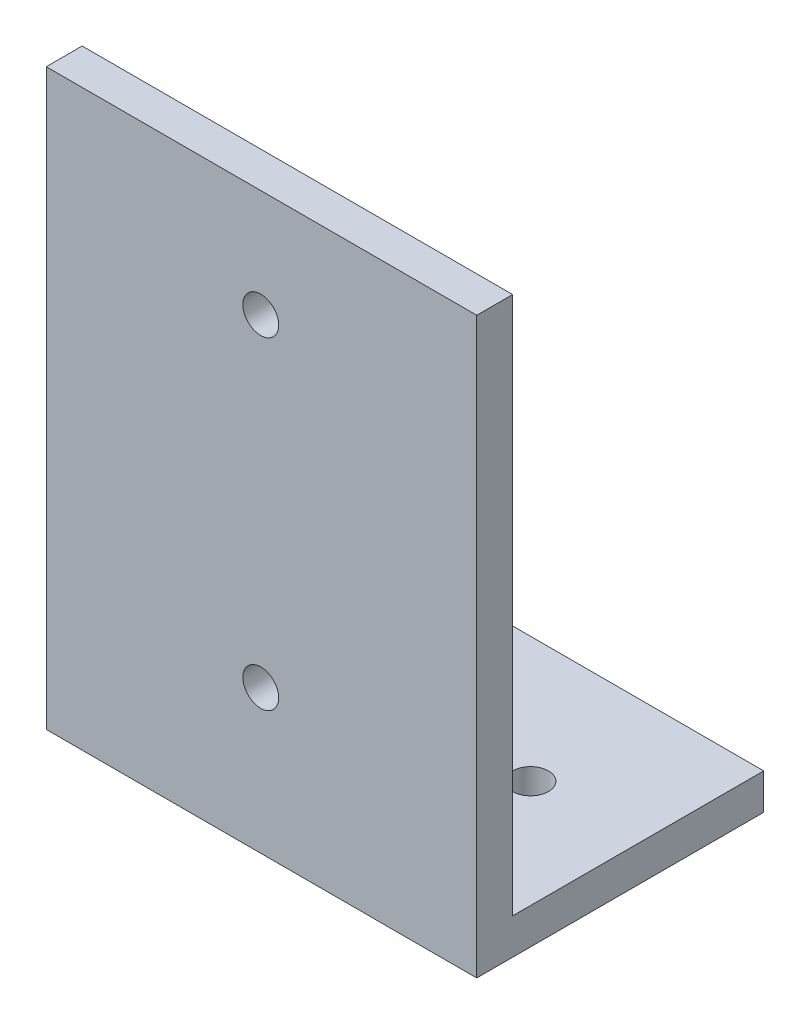
ISO-10303-21;
HEADER;
FILE_DESCRIPTION(('STEP AP214'),'2;1');
FILE_NAME('part.step','',(''),(''),'','','');
FILE_SCHEMA(('AUTOMOTIVE_DESIGN { 1 0 10303 214 1 1 1 1 }'));
ENDSEC;
DATA;
#1=APPLICATION_CONTEXT('core data for automotive mechanical design processes');
#2=APPLICATION_PROTOCOL_DEFINITION('international standard','automotive_design',2000,#1);
#3=PRODUCT_CONTEXT('',#1,'mechanical');
#4=PRODUCT('Part','Part','',(#3));
#5=PRODUCT_RELATED_PRODUCT_CATEGORY('part','',(#4));
#6=PRODUCT_DEFINITION_FORMATION('','',#4);
#7=PRODUCT_DEFINITION_CONTEXT('part definition',#1,'design');
#8=PRODUCT_DEFINITION('design','',#6,#7);
#9=PRODUCT_DEFINITION_SHAPE('','',#8);
#10=(LENGTH_UNIT() NAMED_UNIT(*) SI_UNIT(.MILLI.,.METRE.));
#11=(NAMED_UNIT(*) PLANE_ANGLE_UNIT() SI_UNIT($,.RADIAN.));
#12=(NAMED_UNIT(*) SI_UNIT($,.STERADIAN.) SOLID_ANGLE_UNIT());
#13=UNCERTAINTY_MEASURE_WITH_UNIT(LENGTH_MEASURE(1.E-05),#10,'distance_accuracy_value','');
#14=(GEOMETRIC_REPRESENTATION_CONTEXT(3) GLOBAL_UNCERTAINTY_ASSIGNED_CONTEXT((#13)) GLOBAL_UNIT_ASSIGNED_CONTEXT((#10,
#11,#12)) REPRESENTATION_CONTEXT('',''));
#15=CARTESIAN_POINT('',(0.,0.,0.));
#16=DIRECTION('',(0.,0.,1.));
#17=DIRECTION('',(1.,0.,0.));
#18=AXIS2_PLACEMENT_3D('',#15,#16,#17);
#19=CARTESIAN_POINT('',(38.1,0.,0.));
#20=DIRECTION('',(0.,1.,0.));
#21=DIRECTION('',(0.,0.,1.));
#22=AXIS2_PLACEMENT_3D('',#19,#20,#21);
#23=PLANE('',#22);
#24=CARTESIAN_POINT('',(28.575,0.,-14.2875));
#25=DIRECTION('',(0.,1.,0.));
#26=DIRECTION('',(0.,0.,1.));
#27=AXIS2_PLACEMENT_3D('',#24,#25,#26);
#28=CIRCLE('',#27,1.5875);
#29=CARTESIAN_POINT('',(28.575,0.,-12.7));
#30=VERTEX_POINT('',#29);
#31=EDGE_CURVE('E144',#30,#30,#28,.F.);
#32=ORIENTED_EDGE('',*,*,#31,.F.);
#33=EDGE_LOOP('',(#32));
#34=FACE_BOUND('',#33,.T.);
#35=CARTESIAN_POINT('',(9.52500000000001,0.,-14.2875));
#36=DIRECTION('',(0.,1.,0.));
#37=DIRECTION('',(0.,0.,1.));
#38=AXIS2_PLACEMENT_3D('',#35,#36,#37);
#39=CIRCLE('',#38,1.5875);
#40=CARTESIAN_POINT('',(9.52500000000001,0.,-12.7));
#41=VERTEX_POINT('',#40);
#42=EDGE_CURVE('E197',#41,#41,#39,.F.);
#43=ORIENTED_EDGE('',*,*,#42,.F.);
#44=EDGE_LOOP('',(#43));
#45=FACE_BOUND('',#44,.T.);
#46=DIRECTION('',(0.,0.,-1.));
#47=VECTOR('',#46,1.);
#48=CARTESIAN_POINT('',(0.,0.,0.));
#49=LINE('',#48,#47);
#50=CARTESIAN_POINT('',(0.,0.,0.));
#51=VERTEX_POINT('',#50);
#52=CARTESIAN_POINT('',(0.,0.,-25.4));
#53=VERTEX_POINT('',#52);
#54=EDGE_CURVE('E139',#51,#53,#49,.T.);
#55=ORIENTED_EDGE('',*,*,#54,.T.);
#56=DIRECTION('',(-1.,0.,0.));
#57=VECTOR('',#56,1.);
#58=CARTESIAN_POINT('',(38.1,0.,-25.4));
#59=LINE('',#58,#57);
#60=CARTESIAN_POINT('',(38.1,0.,-25.4));
#61=VERTEX_POINT('',#60);
#62=EDGE_CURVE('E11',#61,#53,#59,.T.);
#63=ORIENTED_EDGE('',*,*,#62,.F.);
#64=DIRECTION('',(0.,0.,-1.));
#65=VECTOR('',#64,1.);
#66=CARTESIAN_POINT('',(38.1,0.,0.));
#67=LINE('',#66,#65);
#68=CARTESIAN_POINT('',(38.1,0.,0.));
#69=VERTEX_POINT('',#68);
#70=EDGE_CURVE('E156',#69,#61,#67,.T.);
#71=ORIENTED_EDGE('',*,*,#70,.F.);
#72=DIRECTION('',(-1.,0.,0.));
#73=VECTOR('',#72,1.);
#74=CARTESIAN_POINT('',(38.1,0.,0.));
#75=LINE('',#74,#73);
#76=EDGE_CURVE('E135',#69,#51,#75,.T.);
#77=ORIENTED_EDGE('',*,*,#76,.T.);
#78=EDGE_LOOP('',(#55,#63,#71,#77));
#79=FACE_BOUND('',#78,.T.);
#80=ADVANCED_FACE('F38',(#34,#45,#79),#23,.F.);
#81=CARTESIAN_POINT('',(38.1,0.,-25.4));
#82=DIRECTION('',(0.,0.,1.));
#83=DIRECTION('',(1.,0.,0.));
#84=AXIS2_PLACEMENT_3D('',#81,#82,#83);
#85=PLANE('',#84);
#86=DIRECTION('',(0.,1.,0.));
#87=VECTOR('',#86,1.);
#88=CARTESIAN_POINT('',(0.,0.,-25.4));
#89=LINE('',#88,#87);
#90=CARTESIAN_POINT('',(0.,3.175,-25.4));
#91=VERTEX_POINT('',#90);
#92=EDGE_CURVE('E143',#53,#91,#89,.T.);
#93=ORIENTED_EDGE('',*,*,#92,.T.);
#94=DIRECTION('',(-1.,0.,0.));
#95=VECTOR('',#94,1.);
#96=CARTESIAN_POINT('',(38.1,3.175,-25.4));
#97=LINE('',#96,#95);
#98=CARTESIAN_POINT('',(38.1,3.175,-25.4));
#99=VERTEX_POINT('',#98);
#100=EDGE_CURVE('E47',#99,#91,#97,.T.);
#101=ORIENTED_EDGE('',*,*,#100,.F.);
#102=DIRECTION('',(0.,1.,0.));
#103=VECTOR('',#102,1.);
#104=CARTESIAN_POINT('',(38.1,0.,-25.4));
#105=LINE('',#104,#103);
#106=EDGE_CURVE('E104',#61,#99,#105,.T.);
#107=ORIENTED_EDGE('',*,*,#106,.F.);
#108=ORIENTED_EDGE('',*,*,#62,.T.);
#109=EDGE_LOOP('',(#93,#101,#107,#108));
#110=FACE_BOUND('',#109,.T.);
#111=ADVANCED_FACE('F187',(#110),#85,.F.);
#112=CARTESIAN_POINT('',(38.1,3.175,-3.175));
#113=DIRECTION('',(0.,-1.,0.));
#114=DIRECTION('',(0.,0.,-1.));
#115=AXIS2_PLACEMENT_3D('',#112,#113,#114);
#116=PLANE('',#115);
#117=CARTESIAN_POINT('',(28.575,3.175,-14.2875));
#118=DIRECTION('',(0.,1.,0.));
#119=DIRECTION('',(0.,0.,1.));
#120=AXIS2_PLACEMENT_3D('',#117,#118,#119);
#121=CIRCLE('',#120,1.5875);
#122=CARTESIAN_POINT('',(28.575,3.175,-12.7));
#123=VERTEX_POINT('',#122);
#124=EDGE_CURVE('E200',#123,#123,#121,.T.);
#125=ORIENTED_EDGE('',*,*,#124,.F.);
#126=EDGE_LOOP('',(#125));
#127=FACE_BOUND('',#126,.T.);
#128=CARTESIAN_POINT('',(9.52500000000001,3.175,-14.2875));
#129=DIRECTION('',(0.,1.,0.));
#130=DIRECTION('',(0.,0.,-1.));
#131=AXIS2_PLACEMENT_3D('',#128,#129,#130);
#132=CIRCLE('',#131,1.5875);
#133=CARTESIAN_POINT('',(9.52500000000001,3.175,-15.875));
#134=VERTEX_POINT('',#133);
#135=EDGE_CURVE('E201',#134,#134,#132,.T.);
#136=ORIENTED_EDGE('',*,*,#135,.F.);
#137=EDGE_LOOP('',(#136));
#138=FACE_BOUND('',#137,.T.);
#139=DIRECTION('',(0.,0.,1.));
#140=VECTOR('',#139,1.);
#141=CARTESIAN_POINT('',(0.,3.175,-3.175));
#142=LINE('',#141,#140);
#143=CARTESIAN_POINT('',(0.,3.175,-3.175));
#144=VERTEX_POINT('',#143);
#145=EDGE_CURVE('E147',#91,#144,#142,.T.);
#146=ORIENTED_EDGE('',*,*,#145,.T.);
#147=DIRECTION('',(-1.,0.,0.));
#148=VECTOR('',#147,1.);
#149=CARTESIAN_POINT('',(38.1,3.175,-3.175));
#150=LINE('',#149,#148);
#151=CARTESIAN_POINT('',(38.1,3.175,-3.175));
#152=VERTEX_POINT('',#151);
#153=EDGE_CURVE('E128',#152,#144,#150,.T.);
#154=ORIENTED_EDGE('',*,*,#153,.F.);
#155=DIRECTION('',(0.,0.,1.));
#156=VECTOR('',#155,1.);
#157=CARTESIAN_POINT('',(38.1,3.175,-3.175));
#158=LINE('',#157,#156);
#159=EDGE_CURVE('E117',#99,#152,#158,.T.);
#160=ORIENTED_EDGE('',*,*,#159,.F.);
#161=ORIENTED_EDGE('',*,*,#100,.T.);
#162=EDGE_LOOP('',(#146,#154,#160,#161));
#163=FACE_BOUND('',#162,.T.);
#164=ADVANCED_FACE('F166',(#127,#138,#163),#116,.F.);
#165=CARTESIAN_POINT('',(38.1,3.175,-3.175));
#166=DIRECTION('',(0.,0.,1.));
#167=DIRECTION('',(1.,0.,0.));
#168=AXIS2_PLACEMENT_3D('',#165,#166,#167);
#169=PLANE('',#168);
#170=CARTESIAN_POINT('',(18.9832981964173,12.7,-3.175));
#171=DIRECTION('',(0.,0.,-1.));
#172=DIRECTION('',(-1.,0.,0.));
#173=AXIS2_PLACEMENT_3D('',#170,#171,#172);
#174=CIRCLE('',#173,1.5875);
#175=CARTESIAN_POINT('',(17.3957981964173,12.7,-3.175));
#176=VERTEX_POINT('',#175);
#177=EDGE_CURVE('E222',#176,#176,#174,.T.);
#178=ORIENTED_EDGE('',*,*,#177,.F.);
#179=EDGE_LOOP('',(#178));
#180=FACE_BOUND('',#179,.T.);
#181=CARTESIAN_POINT('',(18.9832981964173,41.275,-3.175));
#182=DIRECTION('',(0.,0.,-1.));
#183=DIRECTION('',(1.,0.,0.));
#184=AXIS2_PLACEMENT_3D('',#181,#182,#183);
#185=CIRCLE('',#184,1.5875);
#186=CARTESIAN_POINT('',(20.5707981964173,41.275,-3.175));
#187=VERTEX_POINT('',#186);
#188=EDGE_CURVE('E223',#187,#187,#185,.T.);
#189=ORIENTED_EDGE('',*,*,#188,.F.);
#190=EDGE_LOOP('',(#189));
#191=FACE_BOUND('',#190,.T.);
#192=DIRECTION('',(0.,1.,0.));
#193=VECTOR('',#192,1.);
#194=CARTESIAN_POINT('',(0.,3.175,-3.175));
#195=LINE('',#194,#193);
#196=CARTESIAN_POINT('',(0.,50.8,-3.175));
#197=VERTEX_POINT('',#196);
#198=EDGE_CURVE('E126',#144,#197,#195,.T.);
#199=ORIENTED_EDGE('',*,*,#198,.T.);
#200=DIRECTION('',(-1.,0.,0.));
#201=VECTOR('',#200,1.);
#202=CARTESIAN_POINT('',(38.1,50.8,-3.175));
#203=LINE('',#202,#201);
#204=CARTESIAN_POINT('',(38.1,50.8,-3.175));
#205=VERTEX_POINT('',#204);
#206=EDGE_CURVE('E123',#205,#197,#203,.T.);
#207=ORIENTED_EDGE('',*,*,#206,.F.);
#208=DIRECTION('',(0.,1.,0.));
#209=VECTOR('',#208,1.);
#210=CARTESIAN_POINT('',(38.1,3.175,-3.175));
#211=LINE('',#210,#209);
#212=EDGE_CURVE('E111',#152,#205,#211,.T.);
#213=ORIENTED_EDGE('',*,*,#212,.F.);
#214=ORIENTED_EDGE('',*,*,#153,.T.);
#215=EDGE_LOOP('',(#199,#207,#213,#214));
#216=FACE_BOUND('',#215,.T.);
#217=ADVANCED_FACE('F124',(#180,#191,#216),#169,.F.);
#218=CARTESIAN_POINT('',(38.1,50.8,1.92815208244212E-13));
#219=DIRECTION('',(0.,-1.,0.));
#220=DIRECTION('',(0.,0.,-1.));
#221=AXIS2_PLACEMENT_3D('',#218,#219,#220);
#222=PLANE('',#221);
#223=DIRECTION('',(0.,0.,1.));
#224=VECTOR('',#223,1.);
#225=CARTESIAN_POINT('',(0.,50.8,1.92815208244212E-13));
#226=LINE('',#225,#224);
#227=CARTESIAN_POINT('',(0.,50.8,1.92815208244212E-13));
#228=VERTEX_POINT('',#227);
#229=EDGE_CURVE('E87',#197,#228,#226,.T.);
#230=ORIENTED_EDGE('',*,*,#229,.T.);
#231=DIRECTION('',(-1.,0.,0.));
#232=VECTOR('',#231,1.);
#233=CARTESIAN_POINT('',(38.1,50.8,1.92815208244212E-13));
#234=LINE('',#233,#232);
#235=CARTESIAN_POINT('',(38.1,50.8,1.92815208244212E-13));
#236=VERTEX_POINT('',#235);
#237=EDGE_CURVE('E129',#236,#228,#234,.T.);
#238=ORIENTED_EDGE('',*,*,#237,.F.);
#239=DIRECTION('',(0.,0.,1.));
#240=VECTOR('',#239,1.);
#241=CARTESIAN_POINT('',(38.1,50.8,1.92815208244212E-13));
#242=LINE('',#241,#240);
#243=EDGE_CURVE('E115',#205,#236,#242,.T.);
#244=ORIENTED_EDGE('',*,*,#243,.F.);
#245=ORIENTED_EDGE('',*,*,#206,.T.);
#246=EDGE_LOOP('',(#230,#238,#244,#245));
#247=FACE_BOUND('',#246,.T.);
#248=ADVANCED_FACE('F131',(#247),#222,.F.);
#249=CARTESIAN_POINT('',(38.1,0.,0.));
#250=DIRECTION('',(0.,0.,-1.));
#251=DIRECTION('',(0.,1.,0.));
#252=AXIS2_PLACEMENT_3D('',#249,#250,#251);
#253=PLANE('',#252);
#254=CARTESIAN_POINT('',(18.9832981964173,12.7,0.));
#255=DIRECTION('',(0.,0.,-1.));
#256=DIRECTION('',(0.,1.,0.));
#257=AXIS2_PLACEMENT_3D('',#254,#255,#256);
#258=CIRCLE('',#257,1.5875);
#259=CARTESIAN_POINT('',(18.9832981964173,14.2875,0.));
#260=VERTEX_POINT('',#259);
#261=EDGE_CURVE('E208',#260,#260,#258,.F.);
#262=ORIENTED_EDGE('',*,*,#261,.F.);
#263=EDGE_LOOP('',(#262));
#264=FACE_BOUND('',#263,.T.);
#265=CARTESIAN_POINT('',(18.9832981964173,41.275,1.56662343484709E-13));
#266=DIRECTION('',(0.,0.,-1.));
#267=DIRECTION('',(0.,1.,0.));
#268=AXIS2_PLACEMENT_3D('',#265,#266,#267);
#269=CIRCLE('',#268,1.5875);
#270=CARTESIAN_POINT('',(18.9832981964173,42.8625,1.6268781874234E-13));
#271=VERTEX_POINT('',#270);
#272=EDGE_CURVE('E218',#271,#271,#269,.F.);
#273=ORIENTED_EDGE('',*,*,#272,.F.);
#274=EDGE_LOOP('',(#273));
#275=FACE_BOUND('',#274,.T.);
#276=DIRECTION('',(0.,-1.,0.));
#277=VECTOR('',#276,1.);
#278=CARTESIAN_POINT('',(0.,0.,0.));
#279=LINE('',#278,#277);
#280=EDGE_CURVE('E94',#228,#51,#279,.T.);
#281=ORIENTED_EDGE('',*,*,#280,.T.);
#282=ORIENTED_EDGE('',*,*,#76,.F.);
#283=DIRECTION('',(0.,-1.,0.));
#284=VECTOR('',#283,1.);
#285=CARTESIAN_POINT('',(38.1,0.,0.));
#286=LINE('',#285,#284);
#287=EDGE_CURVE('E58',#236,#69,#286,.T.);
#288=ORIENTED_EDGE('',*,*,#287,.F.);
#289=ORIENTED_EDGE('',*,*,#237,.T.);
#290=EDGE_LOOP('',(#281,#282,#288,#289));
#291=FACE_BOUND('',#290,.T.);
#292=ADVANCED_FACE('F173',(#264,#275,#291),#253,.F.);
#293=CARTESIAN_POINT('',(38.1,0.,0.));
#294=DIRECTION('',(1.,0.,0.));
#295=DIRECTION('',(0.,0.,-1.));
#296=AXIS2_PLACEMENT_3D('',#293,#294,#295);
#297=PLANE('',#296);
#298=ORIENTED_EDGE('',*,*,#70,.T.);
#299=ORIENTED_EDGE('',*,*,#106,.T.);
#300=ORIENTED_EDGE('',*,*,#159,.T.);
#301=ORIENTED_EDGE('',*,*,#212,.T.);
#302=ORIENTED_EDGE('',*,*,#243,.T.);
#303=ORIENTED_EDGE('',*,*,#287,.T.);
#304=EDGE_LOOP('',(#298,#299,#300,#301,#302,#303));
#305=FACE_BOUND('',#304,.T.);
#306=ADVANCED_FACE('F113',(#305),#297,.T.);
#307=CARTESIAN_POINT('',(0.,0.,0.));
#308=DIRECTION('',(1.,0.,0.));
#309=DIRECTION('',(0.,0.,-1.));
#310=AXIS2_PLACEMENT_3D('',#307,#308,#309);
#311=PLANE('',#310);
#312=ORIENTED_EDGE('',*,*,#54,.F.);
#313=ORIENTED_EDGE('',*,*,#280,.F.);
#314=ORIENTED_EDGE('',*,*,#229,.F.);
#315=ORIENTED_EDGE('',*,*,#198,.F.);
#316=ORIENTED_EDGE('',*,*,#145,.F.);
#317=ORIENTED_EDGE('',*,*,#92,.F.);
#318=EDGE_LOOP('',(#312,#313,#314,#315,#316,#317));
#319=FACE_BOUND('',#318,.T.);
#320=ADVANCED_FACE('F169',(#319),#311,.F.);
#321=CARTESIAN_POINT('',(9.52500000000001,-0.00100000000000013,-14.2875));
#322=DIRECTION('',(0.,1.,0.));
#323=DIRECTION('',(0.,0.,1.));
#324=AXIS2_PLACEMENT_3D('',#321,#322,#323);
#325=CYLINDRICAL_SURFACE('',#324,1.5875);
#326=ORIENTED_EDGE('',*,*,#135,.T.);
#327=EDGE_LOOP('',(#326));
#328=FACE_BOUND('',#327,.T.);
#329=ORIENTED_EDGE('',*,*,#42,.T.);
#330=EDGE_LOOP('',(#329));
#331=FACE_BOUND('',#330,.T.);
#332=ADVANCED_FACE('F253',(#328,#331),#325,.F.);
#333=CARTESIAN_POINT('',(28.575,-0.00100000000000013,-14.2875));
#334=DIRECTION('',(0.,1.,0.));
#335=DIRECTION('',(0.,0.,1.));
#336=AXIS2_PLACEMENT_3D('',#333,#334,#335);
#337=CYLINDRICAL_SURFACE('',#336,1.5875);
#338=ORIENTED_EDGE('',*,*,#124,.T.);
#339=EDGE_LOOP('',(#338));
#340=FACE_BOUND('',#339,.T.);
#341=ORIENTED_EDGE('',*,*,#31,.T.);
#342=EDGE_LOOP('',(#341));
#343=FACE_BOUND('',#342,.T.);
#344=ADVANCED_FACE('F245',(#340,#343),#337,.F.);
#345=CARTESIAN_POINT('',(18.9832981964173,41.275,0.00100000000019269));
#346=DIRECTION('',(0.,0.,-1.));
#347=DIRECTION('',(-1.,0.,0.));
#348=AXIS2_PLACEMENT_3D('',#345,#346,#347);
#349=CYLINDRICAL_SURFACE('',#348,1.5875);
#350=ORIENTED_EDGE('',*,*,#188,.T.);
#351=EDGE_LOOP('',(#350));
#352=FACE_BOUND('',#351,.T.);
#353=ORIENTED_EDGE('',*,*,#272,.T.);
#354=EDGE_LOOP('',(#353));
#355=FACE_BOUND('',#354,.T.);
#356=ADVANCED_FACE('F242',(#352,#355),#349,.F.);
#357=CARTESIAN_POINT('',(18.9832981964173,12.7,0.00100000000019269));
#358=DIRECTION('',(0.,0.,-1.));
#359=DIRECTION('',(-1.,0.,0.));
#360=AXIS2_PLACEMENT_3D('',#357,#358,#359);
#361=CYLINDRICAL_SURFACE('',#360,1.5875);
#362=ORIENTED_EDGE('',*,*,#177,.T.);
#363=EDGE_LOOP('',(#362));
#364=FACE_BOUND('',#363,.T.);
#365=ORIENTED_EDGE('',*,*,#261,.T.);
#366=EDGE_LOOP('',(#365));
#367=FACE_BOUND('',#366,.T.);
#368=ADVANCED_FACE('F234',(#364,#367),#361,.F.);
#369=CLOSED_SHELL('',(#80,#111,#164,#217,#248,#292,#306,#320,#332,#344,#356,#368));
#370=MANIFOLD_SOLID_BREP('B2',#369);
#371=ADVANCED_BREP_SHAPE_REPRESENTATION('',(#18,#370),#14);
#372=SHAPE_DEFINITION_REPRESENTATION(#9,#371);
ENDSEC;
END-ISO-10303-21;
